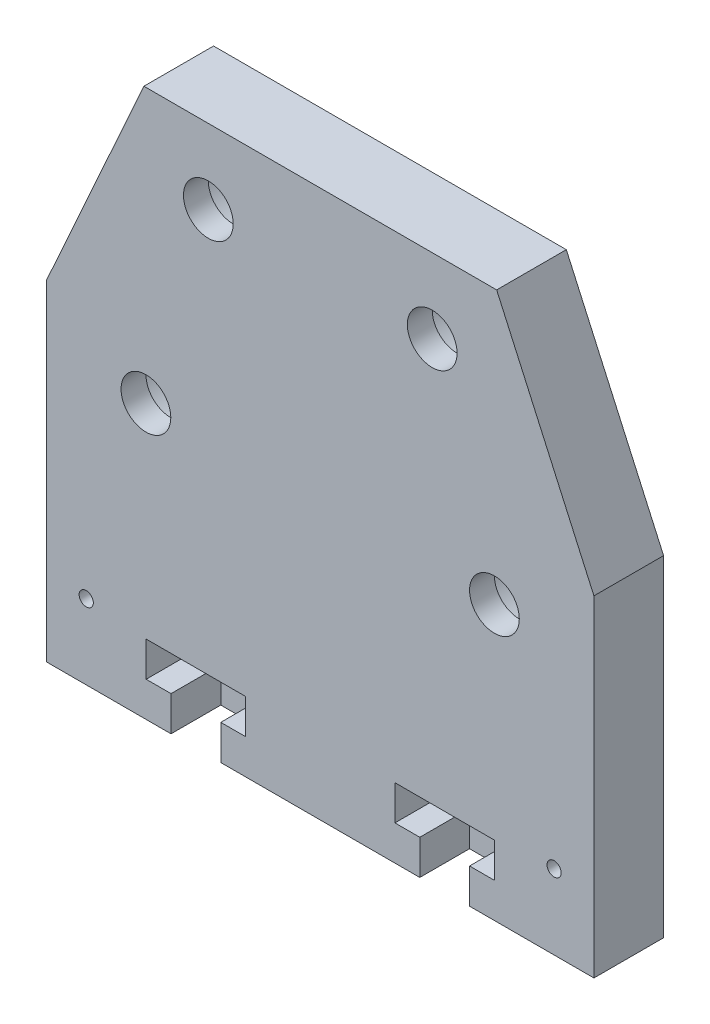
ISO-10303-21;
HEADER;
FILE_DESCRIPTION(('STEP AP214'),'2;1');
FILE_NAME('part.step','',(''),(''),'','','');
FILE_SCHEMA(('AUTOMOTIVE_DESIGN { 1 0 10303 214 1 1 1 1 }'));
ENDSEC;
DATA;
#1=APPLICATION_CONTEXT('core data for automotive mechanical design processes');
#2=APPLICATION_PROTOCOL_DEFINITION('international standard','automotive_design',2000,#1);
#3=PRODUCT_CONTEXT('',#1,'mechanical');
#4=PRODUCT('Part','Part','',(#3));
#5=PRODUCT_RELATED_PRODUCT_CATEGORY('part','',(#4));
#6=PRODUCT_DEFINITION_FORMATION('','',#4);
#7=PRODUCT_DEFINITION_CONTEXT('part definition',#1,'design');
#8=PRODUCT_DEFINITION('design','',#6,#7);
#9=PRODUCT_DEFINITION_SHAPE('','',#8);
#10=(LENGTH_UNIT() NAMED_UNIT(*) SI_UNIT(.MILLI.,.METRE.));
#11=(NAMED_UNIT(*) PLANE_ANGLE_UNIT() SI_UNIT($,.RADIAN.));
#12=(NAMED_UNIT(*) SI_UNIT($,.STERADIAN.) SOLID_ANGLE_UNIT());
#13=UNCERTAINTY_MEASURE_WITH_UNIT(LENGTH_MEASURE(1.E-05),#10,'distance_accuracy_value','');
#14=(GEOMETRIC_REPRESENTATION_CONTEXT(3) GLOBAL_UNCERTAINTY_ASSIGNED_CONTEXT((#13)) GLOBAL_UNIT_ASSIGNED_CONTEXT((#10,
#11,#12)) REPRESENTATION_CONTEXT('',''));
#15=CARTESIAN_POINT('',(0.,0.,0.));
#16=DIRECTION('',(0.,0.,1.));
#17=DIRECTION('',(1.,0.,0.));
#18=AXIS2_PLACEMENT_3D('',#15,#16,#17);
#19=CARTESIAN_POINT('',(104.228904722301,-49.9782608695652,14.));
#20=DIRECTION('',(0.,0.,-1.));
#21=DIRECTION('',(-1.,0.,0.));
#22=AXIS2_PLACEMENT_3D('',#19,#20,#21);
#23=CYLINDRICAL_SURFACE('',#22,11.05);
#24=CARTESIAN_POINT('',(104.228904722301,-49.9782608695652,0.));
#25=DIRECTION('',(0.,0.,1.));
#26=DIRECTION('',(1.,0.,0.));
#27=AXIS2_PLACEMENT_3D('',#24,#25,#26);
#28=CIRCLE('',#27,11.05);
#29=CARTESIAN_POINT('',(115.278904722301,-49.9782608695652,0.));
#30=VERTEX_POINT('',#29);
#31=EDGE_CURVE('E305',#30,#30,#28,.T.);
#32=ORIENTED_EDGE('',*,*,#31,.F.);
#33=EDGE_LOOP('',(#32));
#34=FACE_BOUND('',#33,.T.);
#35=CARTESIAN_POINT('',(104.228904722301,-49.9782608695652,9.));
#36=DIRECTION('',(0.,0.,1.));
#37=DIRECTION('',(1.,0.,0.));
#38=AXIS2_PLACEMENT_3D('',#35,#36,#37);
#39=CIRCLE('',#38,11.05);
#40=CARTESIAN_POINT('',(115.278904722301,-49.9782608695652,9.));
#41=VERTEX_POINT('',#40);
#42=EDGE_CURVE('E836',#41,#41,#39,.T.);
#43=ORIENTED_EDGE('',*,*,#42,.T.);
#44=EDGE_LOOP('',(#43));
#45=FACE_BOUND('',#44,.T.);
#46=ADVANCED_FACE('F32',(#34,#45),#23,.F.);
#47=CARTESIAN_POINT('',(34.187228366783,-49.9782608695652,14.));
#48=DIRECTION('',(0.,0.,-1.));
#49=DIRECTION('',(-1.,0.,0.));
#50=AXIS2_PLACEMENT_3D('',#47,#48,#49);
#51=CYLINDRICAL_SURFACE('',#50,11.05);
#52=CARTESIAN_POINT('',(34.187228366783,-49.9782608695652,0.));
#53=DIRECTION('',(0.,0.,1.));
#54=DIRECTION('',(1.,0.,0.));
#55=AXIS2_PLACEMENT_3D('',#52,#53,#54);
#56=CIRCLE('',#55,11.05);
#57=CARTESIAN_POINT('',(45.237228366783,-49.9782608695652,0.));
#58=VERTEX_POINT('',#57);
#59=EDGE_CURVE('E287',#58,#58,#56,.T.);
#60=ORIENTED_EDGE('',*,*,#59,.F.);
#61=EDGE_LOOP('',(#60));
#62=FACE_BOUND('',#61,.T.);
#63=CARTESIAN_POINT('',(34.187228366783,-49.9782608695652,9.));
#64=DIRECTION('',(0.,0.,1.));
#65=DIRECTION('',(1.,0.,0.));
#66=AXIS2_PLACEMENT_3D('',#63,#64,#65);
#67=CIRCLE('',#66,11.05);
#68=CARTESIAN_POINT('',(45.237228366783,-49.9782608695652,9.));
#69=VERTEX_POINT('',#68);
#70=EDGE_CURVE('E841',#69,#69,#67,.T.);
#71=ORIENTED_EDGE('',*,*,#70,.T.);
#72=EDGE_LOOP('',(#71));
#73=FACE_BOUND('',#72,.T.);
#74=ADVANCED_FACE('F452',(#62,#73),#51,.F.);
#75=CARTESIAN_POINT('',(91.7289047223011,-9.97826086956522,14.));
#76=DIRECTION('',(0.,0.,-1.));
#77=DIRECTION('',(-1.,0.,0.));
#78=AXIS2_PLACEMENT_3D('',#75,#76,#77);
#79=CYLINDRICAL_SURFACE('',#78,11.05);
#80=CARTESIAN_POINT('',(91.7289047223011,-9.97826086956522,0.));
#81=DIRECTION('',(0.,0.,1.));
#82=DIRECTION('',(1.,0.,0.));
#83=AXIS2_PLACEMENT_3D('',#80,#81,#82);
#84=CIRCLE('',#83,11.05);
#85=CARTESIAN_POINT('',(102.778904722301,-9.97826086956522,0.));
#86=VERTEX_POINT('',#85);
#87=EDGE_CURVE('E311',#86,#86,#84,.T.);
#88=ORIENTED_EDGE('',*,*,#87,.F.);
#89=EDGE_LOOP('',(#88));
#90=FACE_BOUND('',#89,.T.);
#91=CARTESIAN_POINT('',(91.7289047223011,-9.97826086956522,9.));
#92=DIRECTION('',(0.,0.,1.));
#93=DIRECTION('',(1.,0.,0.));
#94=AXIS2_PLACEMENT_3D('',#91,#92,#93);
#95=CIRCLE('',#94,11.05);
#96=CARTESIAN_POINT('',(102.778904722301,-9.97826086956522,9.));
#97=VERTEX_POINT('',#96);
#98=EDGE_CURVE('E843',#97,#97,#95,.T.);
#99=ORIENTED_EDGE('',*,*,#98,.T.);
#100=EDGE_LOOP('',(#99));
#101=FACE_BOUND('',#100,.T.);
#102=ADVANCED_FACE('F458',(#90,#101),#79,.F.);
#103=CARTESIAN_POINT('',(46.7289047223011,-9.97826086956521,14.));
#104=DIRECTION('',(0.,0.,-1.));
#105=DIRECTION('',(-1.,0.,0.));
#106=AXIS2_PLACEMENT_3D('',#103,#104,#105);
#107=CYLINDRICAL_SURFACE('',#106,11.05);
#108=CARTESIAN_POINT('',(46.7289047223011,-9.97826086956521,0.));
#109=DIRECTION('',(0.,0.,1.));
#110=DIRECTION('',(1.,0.,0.));
#111=AXIS2_PLACEMENT_3D('',#108,#109,#110);
#112=CIRCLE('',#111,11.05);
#113=CARTESIAN_POINT('',(57.7789047223011,-9.97826086956521,0.));
#114=VERTEX_POINT('',#113);
#115=EDGE_CURVE('E308',#114,#114,#112,.T.);
#116=ORIENTED_EDGE('',*,*,#115,.F.);
#117=EDGE_LOOP('',(#116));
#118=FACE_BOUND('',#117,.T.);
#119=CARTESIAN_POINT('',(46.7289047223011,-9.97826086956521,9.));
#120=DIRECTION('',(0.,0.,1.));
#121=DIRECTION('',(1.,0.,0.));
#122=AXIS2_PLACEMENT_3D('',#119,#120,#121);
#123=CIRCLE('',#122,11.05);
#124=CARTESIAN_POINT('',(57.7789047223011,-9.97826086956521,9.));
#125=VERTEX_POINT('',#124);
#126=EDGE_CURVE('E216',#125,#125,#123,.T.);
#127=ORIENTED_EDGE('',*,*,#126,.T.);
#128=EDGE_LOOP('',(#127));
#129=FACE_BOUND('',#128,.T.);
#130=ADVANCED_FACE('F465',(#118,#129),#107,.F.);
#131=CARTESIAN_POINT('',(0.,0.,14.));
#132=DIRECTION('',(0.,0.,-1.));
#133=DIRECTION('',(-1.,0.,0.));
#134=AXIS2_PLACEMENT_3D('',#131,#132,#133);
#135=PLANE('',#134);
#136=CARTESIAN_POINT('',(116.228904722301,-89.9782608695652,14.));
#137=DIRECTION('',(0.,0.,1.));
#138=DIRECTION('',(1.,0.,0.));
#139=AXIS2_PLACEMENT_3D('',#136,#137,#138);
#140=CIRCLE('',#139,1.425);
#141=CARTESIAN_POINT('',(117.653904722301,-89.9782608695652,14.));
#142=VERTEX_POINT('',#141);
#143=EDGE_CURVE('E824',#142,#142,#140,.T.);
#144=ORIENTED_EDGE('',*,*,#143,.F.);
#145=EDGE_LOOP('',(#144));
#146=FACE_BOUND('',#145,.T.);
#147=CARTESIAN_POINT('',(22.187228366783,-89.9782608695652,14.));
#148=DIRECTION('',(0.,0.,1.));
#149=DIRECTION('',(1.,0.,0.));
#150=AXIS2_PLACEMENT_3D('',#147,#148,#149);
#151=CIRCLE('',#150,1.425);
#152=CARTESIAN_POINT('',(23.612228366783,-89.9782608695652,14.));
#153=VERTEX_POINT('',#152);
#154=EDGE_CURVE('E830',#153,#153,#151,.T.);
#155=ORIENTED_EDGE('',*,*,#154,.F.);
#156=EDGE_LOOP('',(#155));
#157=FACE_BOUND('',#156,.T.);
#158=DIRECTION('',(0.,-1.,0.));
#159=VECTOR('',#158,1.);
#160=CARTESIAN_POINT('',(99.231884057971,0.,14.));
#161=LINE('',#160,#159);
#162=CARTESIAN_POINT('',(99.231884057971,-97.9782608695652,14.));
#163=VERTEX_POINT('',#162);
#164=CARTESIAN_POINT('',(99.231884057971,-104.978260869565,14.));
#165=VERTEX_POINT('',#164);
#166=EDGE_CURVE('E212',#163,#165,#161,.T.);
#167=ORIENTED_EDGE('',*,*,#166,.T.);
#168=DIRECTION('',(1.,0.,0.));
#169=VECTOR('',#168,1.);
#170=CARTESIAN_POINT('',(124.228904722301,-104.978260869565,14.));
#171=LINE('',#170,#169);
#172=CARTESIAN_POINT('',(124.228904722301,-104.978260869565,14.));
#173=VERTEX_POINT('',#172);
#174=EDGE_CURVE('E327',#165,#173,#171,.T.);
#175=ORIENTED_EDGE('',*,*,#174,.T.);
#176=DIRECTION('',(0.,1.,0.));
#177=VECTOR('',#176,1.);
#178=CARTESIAN_POINT('',(124.228904722301,-38.4636097407532,14.));
#179=LINE('',#178,#177);
#180=CARTESIAN_POINT('',(124.228904722301,-38.4636097407532,14.));
#181=VERTEX_POINT('',#180);
#182=EDGE_CURVE('E315',#173,#181,#179,.T.);
#183=ORIENTED_EDGE('',*,*,#182,.T.);
#184=DIRECTION('',(-0.41,0.912085522305886,0.));
#185=VECTOR('',#184,1.);
#186=CARTESIAN_POINT('',(104.681403308056,5.02173913043479,14.));
#187=LINE('',#186,#185);
#188=CARTESIAN_POINT('',(104.681403308056,5.02173913043479,14.));
#189=VERTEX_POINT('',#188);
#190=EDGE_CURVE('E318',#181,#189,#187,.T.);
#191=ORIENTED_EDGE('',*,*,#190,.T.);
#192=DIRECTION('',(-1.,0.,0.));
#193=VECTOR('',#192,1.);
#194=CARTESIAN_POINT('',(104.681403308056,5.02173913043479,14.));
#195=LINE('',#194,#193);
#196=CARTESIAN_POINT('',(33.7823648078864,5.02173913043478,14.));
#197=VERTEX_POINT('',#196);
#198=EDGE_CURVE('E321',#189,#197,#195,.T.);
#199=ORIENTED_EDGE('',*,*,#198,.T.);
#200=DIRECTION('',(-0.41,-0.912085522305886,0.));
#201=VECTOR('',#200,1.);
#202=CARTESIAN_POINT('',(33.7823648078864,5.02173913043478,14.));
#203=LINE('',#202,#201);
#204=CARTESIAN_POINT('',(14.187228366783,-38.5695785660015,14.));
#205=VERTEX_POINT('',#204);
#206=EDGE_CURVE('E323',#197,#205,#203,.T.);
#207=ORIENTED_EDGE('',*,*,#206,.T.);
#208=DIRECTION('',(0.,-1.,0.));
#209=VECTOR('',#208,1.);
#210=CARTESIAN_POINT('',(14.187228366783,-38.5695785660015,14.));
#211=LINE('',#210,#209);
#212=CARTESIAN_POINT('',(14.187228366783,-104.978260869565,14.));
#213=VERTEX_POINT('',#212);
#214=EDGE_CURVE('E325',#205,#213,#211,.T.);
#215=ORIENTED_EDGE('',*,*,#214,.T.);
#216=CARTESIAN_POINT('',(39.231884057971,-104.978260869565,14.));
#217=VERTEX_POINT('',#216);
#218=EDGE_CURVE('E328',#213,#217,#171,.T.);
#219=ORIENTED_EDGE('',*,*,#218,.T.);
#220=DIRECTION('',(0.,-1.,0.));
#221=VECTOR('',#220,1.);
#222=CARTESIAN_POINT('',(39.231884057971,0.,14.));
#223=LINE('',#222,#221);
#224=CARTESIAN_POINT('',(39.231884057971,-97.9782608695652,14.));
#225=VERTEX_POINT('',#224);
#226=EDGE_CURVE('E280',#225,#217,#223,.T.);
#227=ORIENTED_EDGE('',*,*,#226,.F.);
#228=DIRECTION('',(1.,0.,0.));
#229=VECTOR('',#228,1.);
#230=CARTESIAN_POINT('',(0.,-97.9782608695652,14.));
#231=LINE('',#230,#229);
#232=CARTESIAN_POINT('',(34.231884057971,-97.9782608695652,14.));
#233=VERTEX_POINT('',#232);
#234=EDGE_CURVE('E277',#233,#225,#231,.T.);
#235=ORIENTED_EDGE('',*,*,#234,.F.);
#236=DIRECTION('',(0.,-1.,0.));
#237=VECTOR('',#236,1.);
#238=CARTESIAN_POINT('',(34.2318840579711,0.,14.));
#239=LINE('',#238,#237);
#240=CARTESIAN_POINT('',(34.231884057971,-90.9782608695652,14.));
#241=VERTEX_POINT('',#240);
#242=EDGE_CURVE('E274',#241,#233,#239,.T.);
#243=ORIENTED_EDGE('',*,*,#242,.F.);
#244=DIRECTION('',(1.,0.,0.));
#245=VECTOR('',#244,1.);
#246=CARTESIAN_POINT('',(0.,-90.9782608695652,14.));
#247=LINE('',#246,#245);
#248=CARTESIAN_POINT('',(54.231884057971,-90.9782608695652,14.));
#249=VERTEX_POINT('',#248);
#250=EDGE_CURVE('E271',#241,#249,#247,.T.);
#251=ORIENTED_EDGE('',*,*,#250,.T.);
#252=DIRECTION('',(0.,-1.,0.));
#253=VECTOR('',#252,1.);
#254=CARTESIAN_POINT('',(54.2318840579709,0.,14.));
#255=LINE('',#254,#253);
#256=CARTESIAN_POINT('',(54.231884057971,-97.9782608695652,14.));
#257=VERTEX_POINT('',#256);
#258=EDGE_CURVE('E240',#249,#257,#255,.T.);
#259=ORIENTED_EDGE('',*,*,#258,.T.);
#260=CARTESIAN_POINT('',(49.231884057971,-97.9782608695652,14.));
#261=VERTEX_POINT('',#260);
#262=EDGE_CURVE('E256',#261,#257,#231,.T.);
#263=ORIENTED_EDGE('',*,*,#262,.F.);
#264=DIRECTION('',(0.,-1.,0.));
#265=VECTOR('',#264,1.);
#266=CARTESIAN_POINT('',(49.2318840579711,0.,14.));
#267=LINE('',#266,#265);
#268=CARTESIAN_POINT('',(49.231884057971,-104.978260869565,14.));
#269=VERTEX_POINT('',#268);
#270=EDGE_CURVE('E282',#261,#269,#267,.T.);
#271=ORIENTED_EDGE('',*,*,#270,.T.);
#272=CARTESIAN_POINT('',(89.231884057971,-104.978260869565,14.));
#273=VERTEX_POINT('',#272);
#274=EDGE_CURVE('E332',#269,#273,#171,.T.);
#275=ORIENTED_EDGE('',*,*,#274,.T.);
#276=DIRECTION('',(0.,-1.,0.));
#277=VECTOR('',#276,1.);
#278=CARTESIAN_POINT('',(89.231884057971,0.,14.));
#279=LINE('',#278,#277);
#280=CARTESIAN_POINT('',(89.231884057971,-97.9782608695652,14.));
#281=VERTEX_POINT('',#280);
#282=EDGE_CURVE('E234',#281,#273,#279,.T.);
#283=ORIENTED_EDGE('',*,*,#282,.F.);
#284=DIRECTION('',(1.,0.,0.));
#285=VECTOR('',#284,1.);
#286=CARTESIAN_POINT('',(0.,-97.9782608695652,14.));
#287=LINE('',#286,#285);
#288=CARTESIAN_POINT('',(84.231884057971,-97.9782608695652,14.));
#289=VERTEX_POINT('',#288);
#290=EDGE_CURVE('E214',#289,#281,#287,.T.);
#291=ORIENTED_EDGE('',*,*,#290,.F.);
#292=DIRECTION('',(0.,-1.,0.));
#293=VECTOR('',#292,1.);
#294=CARTESIAN_POINT('',(84.231884057971,0.,14.));
#295=LINE('',#294,#293);
#296=CARTESIAN_POINT('',(84.231884057971,-90.9782608695652,14.));
#297=VERTEX_POINT('',#296);
#298=EDGE_CURVE('E230',#297,#289,#295,.T.);
#299=ORIENTED_EDGE('',*,*,#298,.F.);
#300=DIRECTION('',(1.,0.,0.));
#301=VECTOR('',#300,1.);
#302=CARTESIAN_POINT('',(0.,-90.9782608695652,14.));
#303=LINE('',#302,#301);
#304=CARTESIAN_POINT('',(104.231884057971,-90.9782608695652,14.));
#305=VERTEX_POINT('',#304);
#306=EDGE_CURVE('E228',#297,#305,#303,.T.);
#307=ORIENTED_EDGE('',*,*,#306,.T.);
#308=DIRECTION('',(0.,-1.,0.));
#309=VECTOR('',#308,1.);
#310=CARTESIAN_POINT('',(104.231884057971,0.,14.));
#311=LINE('',#310,#309);
#312=CARTESIAN_POINT('',(104.231884057971,-97.9782608695652,14.));
#313=VERTEX_POINT('',#312);
#314=EDGE_CURVE('E201',#305,#313,#311,.T.);
#315=ORIENTED_EDGE('',*,*,#314,.T.);
#316=EDGE_CURVE('E209',#163,#313,#287,.T.);
#317=ORIENTED_EDGE('',*,*,#316,.F.);
#318=EDGE_LOOP('',(#167,#175,#183,#191,#199,#207,#215,#219,#227,#235,#243,#251,#259,#263,#271,
#275,#283,#291,#299,#307,#315,#317));
#319=FACE_BOUND('',#318,.T.);
#320=CARTESIAN_POINT('',(46.7289047223011,-9.97826086956521,14.));
#321=DIRECTION('',(0.,0.,1.));
#322=DIRECTION('',(1.,0.,0.));
#323=AXIS2_PLACEMENT_3D('',#320,#321,#322);
#324=CIRCLE('',#323,5.);
#325=CARTESIAN_POINT('',(51.7289047223011,-9.97826086956521,14.));
#326=VERTEX_POINT('',#325);
#327=EDGE_CURVE('E818',#326,#326,#324,.T.);
#328=ORIENTED_EDGE('',*,*,#327,.F.);
#329=EDGE_LOOP('',(#328));
#330=FACE_BOUND('',#329,.T.);
#331=CARTESIAN_POINT('',(91.7289047223011,-9.97826086956522,14.));
#332=DIRECTION('',(0.,0.,1.));
#333=DIRECTION('',(1.,0.,0.));
#334=AXIS2_PLACEMENT_3D('',#331,#332,#333);
#335=CIRCLE('',#334,5.);
#336=CARTESIAN_POINT('',(96.7289047223011,-9.97826086956522,14.));
#337=VERTEX_POINT('',#336);
#338=EDGE_CURVE('E812',#337,#337,#335,.T.);
#339=ORIENTED_EDGE('',*,*,#338,.F.);
#340=EDGE_LOOP('',(#339));
#341=FACE_BOUND('',#340,.T.);
#342=CARTESIAN_POINT('',(104.228904722301,-49.9782608695652,14.));
#343=DIRECTION('',(0.,0.,1.));
#344=DIRECTION('',(1.,0.,0.));
#345=AXIS2_PLACEMENT_3D('',#342,#343,#344);
#346=CIRCLE('',#345,5.00000000000001);
#347=CARTESIAN_POINT('',(109.228904722301,-49.9782608695652,14.));
#348=VERTEX_POINT('',#347);
#349=EDGE_CURVE('E806',#348,#348,#346,.T.);
#350=ORIENTED_EDGE('',*,*,#349,.F.);
#351=EDGE_LOOP('',(#350));
#352=FACE_BOUND('',#351,.T.);
#353=CARTESIAN_POINT('',(34.187228366783,-49.9782608695652,14.));
#354=DIRECTION('',(0.,0.,1.));
#355=DIRECTION('',(1.,0.,0.));
#356=AXIS2_PLACEMENT_3D('',#353,#354,#355);
#357=CIRCLE('',#356,5.);
#358=CARTESIAN_POINT('',(39.187228366783,-49.9782608695652,14.));
#359=VERTEX_POINT('',#358);
#360=EDGE_CURVE('E803',#359,#359,#357,.T.);
#361=ORIENTED_EDGE('',*,*,#360,.F.);
#362=EDGE_LOOP('',(#361));
#363=FACE_BOUND('',#362,.T.);
#364=ADVANCED_FACE('F379',(#146,#157,#319,#330,#341,#352,#363),#135,.F.);
#365=CARTESIAN_POINT('',(124.228904722301,-104.978260869565,14.));
#366=DIRECTION('',(0.,1.,0.));
#367=DIRECTION('',(0.,0.,1.));
#368=AXIS2_PLACEMENT_3D('',#365,#366,#367);
#369=PLANE('',#368);
#370=DIRECTION('',(0.,0.,1.));
#371=VECTOR('',#370,1.);
#372=CARTESIAN_POINT('',(99.231884057971,-104.978260869565,4.));
#373=LINE('',#372,#371);
#374=CARTESIAN_POINT('',(99.231884057971,-104.978260869565,4.));
#375=VERTEX_POINT('',#374);
#376=EDGE_CURVE('E243',#375,#165,#373,.T.);
#377=ORIENTED_EDGE('',*,*,#376,.F.);
#378=DIRECTION('',(1.,0.,0.));
#379=VECTOR('',#378,1.);
#380=CARTESIAN_POINT('',(0.,-104.978260869565,4.));
#381=LINE('',#380,#379);
#382=CARTESIAN_POINT('',(89.231884057971,-104.978260869565,4.));
#383=VERTEX_POINT('',#382);
#384=EDGE_CURVE('E223',#383,#375,#381,.T.);
#385=ORIENTED_EDGE('',*,*,#384,.F.);
#386=DIRECTION('',(0.,0.,1.));
#387=VECTOR('',#386,1.);
#388=CARTESIAN_POINT('',(89.231884057971,-104.978260869565,4.));
#389=LINE('',#388,#387);
#390=EDGE_CURVE('E245',#383,#273,#389,.T.);
#391=ORIENTED_EDGE('',*,*,#390,.T.);
#392=ORIENTED_EDGE('',*,*,#274,.F.);
#393=DIRECTION('',(0.,0.,1.));
#394=VECTOR('',#393,1.);
#395=CARTESIAN_POINT('',(49.231884057971,-104.978260869565,4.));
#396=LINE('',#395,#394);
#397=CARTESIAN_POINT('',(49.231884057971,-104.978260869565,4.));
#398=VERTEX_POINT('',#397);
#399=EDGE_CURVE('E290',#398,#269,#396,.T.);
#400=ORIENTED_EDGE('',*,*,#399,.F.);
#401=DIRECTION('',(1.,0.,0.));
#402=VECTOR('',#401,1.);
#403=CARTESIAN_POINT('',(0.,-104.978260869565,4.));
#404=LINE('',#403,#402);
#405=CARTESIAN_POINT('',(39.231884057971,-104.978260869565,4.));
#406=VERTEX_POINT('',#405);
#407=EDGE_CURVE('E265',#406,#398,#404,.T.);
#408=ORIENTED_EDGE('',*,*,#407,.F.);
#409=DIRECTION('',(0.,0.,1.));
#410=VECTOR('',#409,1.);
#411=CARTESIAN_POINT('',(39.231884057971,-104.978260869565,4.));
#412=LINE('',#411,#410);
#413=EDGE_CURVE('E292',#406,#217,#412,.T.);
#414=ORIENTED_EDGE('',*,*,#413,.T.);
#415=ORIENTED_EDGE('',*,*,#218,.F.);
#416=DIRECTION('',(0.,0.,-1.));
#417=VECTOR('',#416,1.);
#418=CARTESIAN_POINT('',(14.187228366783,-104.978260869565,14.));
#419=LINE('',#418,#417);
#420=CARTESIAN_POINT('',(14.187228366783,-104.978260869565,0.));
#421=VERTEX_POINT('',#420);
#422=EDGE_CURVE('E346',#213,#421,#419,.T.);
#423=ORIENTED_EDGE('',*,*,#422,.T.);
#424=DIRECTION('',(1.,0.,0.));
#425=VECTOR('',#424,1.);
#426=CARTESIAN_POINT('',(124.228904722301,-104.978260869565,0.));
#427=LINE('',#426,#425);
#428=CARTESIAN_POINT('',(124.228904722301,-104.978260869565,0.));
#429=VERTEX_POINT('',#428);
#430=EDGE_CURVE('E319',#421,#429,#427,.T.);
#431=ORIENTED_EDGE('',*,*,#430,.T.);
#432=DIRECTION('',(0.,0.,-1.));
#433=VECTOR('',#432,1.);
#434=CARTESIAN_POINT('',(124.228904722301,-104.978260869565,14.));
#435=LINE('',#434,#433);
#436=EDGE_CURVE('E331',#173,#429,#435,.T.);
#437=ORIENTED_EDGE('',*,*,#436,.F.);
#438=ORIENTED_EDGE('',*,*,#174,.F.);
#439=EDGE_LOOP('',(#377,#385,#391,#392,#400,#408,#414,#415,#423,#431,#437,#438));
#440=FACE_BOUND('',#439,.T.);
#441=ADVANCED_FACE('F389',(#440),#369,.F.);
#442=CARTESIAN_POINT('',(0.,0.,0.));
#443=DIRECTION('',(0.,0.,-1.));
#444=DIRECTION('',(-1.,0.,0.));
#445=AXIS2_PLACEMENT_3D('',#442,#443,#444);
#446=PLANE('',#445);
#447=CARTESIAN_POINT('',(116.228904722301,-89.9782608695652,0.));
#448=DIRECTION('',(0.,0.,1.));
#449=DIRECTION('',(1.,0.,0.));
#450=AXIS2_PLACEMENT_3D('',#447,#448,#449);
#451=CIRCLE('',#450,1.425);
#452=CARTESIAN_POINT('',(117.653904722301,-89.9782608695652,0.));
#453=VERTEX_POINT('',#452);
#454=EDGE_CURVE('E827',#453,#453,#451,.T.);
#455=ORIENTED_EDGE('',*,*,#454,.T.);
#456=EDGE_LOOP('',(#455));
#457=FACE_BOUND('',#456,.T.);
#458=CARTESIAN_POINT('',(22.187228366783,-89.9782608695652,0.));
#459=DIRECTION('',(0.,0.,1.));
#460=DIRECTION('',(1.,0.,0.));
#461=AXIS2_PLACEMENT_3D('',#458,#459,#460);
#462=CIRCLE('',#461,1.425);
#463=CARTESIAN_POINT('',(23.612228366783,-89.9782608695652,0.));
#464=VERTEX_POINT('',#463);
#465=EDGE_CURVE('E833',#464,#464,#462,.T.);
#466=ORIENTED_EDGE('',*,*,#465,.T.);
#467=EDGE_LOOP('',(#466));
#468=FACE_BOUND('',#467,.T.);
#469=ORIENTED_EDGE('',*,*,#31,.T.);
#470=EDGE_LOOP('',(#469));
#471=FACE_BOUND('',#470,.T.);
#472=ORIENTED_EDGE('',*,*,#87,.T.);
#473=EDGE_LOOP('',(#472));
#474=FACE_BOUND('',#473,.T.);
#475=DIRECTION('',(0.,1.,0.));
#476=VECTOR('',#475,1.);
#477=CARTESIAN_POINT('',(124.228904722301,-38.4636097407532,0.));
#478=LINE('',#477,#476);
#479=CARTESIAN_POINT('',(124.228904722301,-38.4636097407532,0.));
#480=VERTEX_POINT('',#479);
#481=EDGE_CURVE('E314',#429,#480,#478,.T.);
#482=ORIENTED_EDGE('',*,*,#481,.F.);
#483=ORIENTED_EDGE('',*,*,#430,.F.);
#484=DIRECTION('',(0.,-1.,0.));
#485=VECTOR('',#484,1.);
#486=CARTESIAN_POINT('',(14.187228366783,-38.5695785660015,0.));
#487=LINE('',#486,#485);
#488=CARTESIAN_POINT('',(14.187228366783,-38.5695785660015,0.));
#489=VERTEX_POINT('',#488);
#490=EDGE_CURVE('E341',#489,#421,#487,.T.);
#491=ORIENTED_EDGE('',*,*,#490,.F.);
#492=DIRECTION('',(-0.41,-0.912085522305886,0.));
#493=VECTOR('',#492,1.);
#494=CARTESIAN_POINT('',(33.7823648078864,5.02173913043478,0.));
#495=LINE('',#494,#493);
#496=CARTESIAN_POINT('',(33.7823648078864,5.02173913043478,0.));
#497=VERTEX_POINT('',#496);
#498=EDGE_CURVE('E339',#497,#489,#495,.T.);
#499=ORIENTED_EDGE('',*,*,#498,.F.);
#500=DIRECTION('',(-1.,0.,0.));
#501=VECTOR('',#500,1.);
#502=CARTESIAN_POINT('',(104.681403308056,5.02173913043479,0.));
#503=LINE('',#502,#501);
#504=CARTESIAN_POINT('',(104.681403308056,5.02173913043479,0.));
#505=VERTEX_POINT('',#504);
#506=EDGE_CURVE('E337',#505,#497,#503,.T.);
#507=ORIENTED_EDGE('',*,*,#506,.F.);
#508=DIRECTION('',(-0.41,0.912085522305886,0.));
#509=VECTOR('',#508,1.);
#510=CARTESIAN_POINT('',(104.681403308056,5.02173913043479,0.));
#511=LINE('',#510,#509);
#512=EDGE_CURVE('E335',#480,#505,#511,.T.);
#513=ORIENTED_EDGE('',*,*,#512,.F.);
#514=EDGE_LOOP('',(#482,#483,#491,#499,#507,#513));
#515=FACE_BOUND('',#514,.T.);
#516=ORIENTED_EDGE('',*,*,#115,.T.);
#517=EDGE_LOOP('',(#516));
#518=FACE_BOUND('',#517,.T.);
#519=ORIENTED_EDGE('',*,*,#59,.T.);
#520=EDGE_LOOP('',(#519));
#521=FACE_BOUND('',#520,.T.);
#522=ADVANCED_FACE('F365',(#457,#468,#471,#474,#515,#518,#521),#446,.T.);
#523=CARTESIAN_POINT('',(124.228904722301,-38.4636097407532,14.));
#524=DIRECTION('',(-1.,0.,0.));
#525=DIRECTION('',(0.,-1.,0.));
#526=AXIS2_PLACEMENT_3D('',#523,#524,#525);
#527=PLANE('',#526);
#528=ORIENTED_EDGE('',*,*,#481,.T.);
#529=DIRECTION('',(0.,0.,-1.));
#530=VECTOR('',#529,1.);
#531=CARTESIAN_POINT('',(124.228904722301,-38.4636097407532,14.));
#532=LINE('',#531,#530);
#533=EDGE_CURVE('E11',#181,#480,#532,.T.);
#534=ORIENTED_EDGE('',*,*,#533,.F.);
#535=ORIENTED_EDGE('',*,*,#182,.F.);
#536=ORIENTED_EDGE('',*,*,#436,.T.);
#537=EDGE_LOOP('',(#528,#534,#535,#536));
#538=FACE_BOUND('',#537,.T.);
#539=ADVANCED_FACE('F34',(#538),#527,.F.);
#540=CARTESIAN_POINT('',(104.681403308056,5.02173913043479,14.));
#541=DIRECTION('',(-0.912085522305886,-0.41,0.));
#542=DIRECTION('',(0.41,-0.912085522305886,0.));
#543=AXIS2_PLACEMENT_3D('',#540,#541,#542);
#544=PLANE('',#543);
#545=ORIENTED_EDGE('',*,*,#512,.T.);
#546=DIRECTION('',(0.,0.,-1.));
#547=VECTOR('',#546,1.);
#548=CARTESIAN_POINT('',(104.681403308056,5.02173913043479,14.));
#549=LINE('',#548,#547);
#550=EDGE_CURVE('E40',#189,#505,#549,.T.);
#551=ORIENTED_EDGE('',*,*,#550,.F.);
#552=ORIENTED_EDGE('',*,*,#190,.F.);
#553=ORIENTED_EDGE('',*,*,#533,.T.);
#554=EDGE_LOOP('',(#545,#551,#552,#553));
#555=FACE_BOUND('',#554,.T.);
#556=ADVANCED_FACE('F384',(#555),#544,.F.);
#557=CARTESIAN_POINT('',(104.681403308056,5.02173913043479,14.));
#558=DIRECTION('',(0.,-1.,0.));
#559=DIRECTION('',(1.,0.,0.));
#560=AXIS2_PLACEMENT_3D('',#557,#558,#559);
#561=PLANE('',#560);
#562=ORIENTED_EDGE('',*,*,#506,.T.);
#563=DIRECTION('',(0.,0.,-1.));
#564=VECTOR('',#563,1.);
#565=CARTESIAN_POINT('',(33.7823648078864,5.02173913043478,14.));
#566=LINE('',#565,#564);
#567=EDGE_CURVE('E352',#197,#497,#566,.T.);
#568=ORIENTED_EDGE('',*,*,#567,.F.);
#569=ORIENTED_EDGE('',*,*,#198,.F.);
#570=ORIENTED_EDGE('',*,*,#550,.T.);
#571=EDGE_LOOP('',(#562,#568,#569,#570));
#572=FACE_BOUND('',#571,.T.);
#573=ADVANCED_FACE('F359',(#572),#561,.F.);
#574=CARTESIAN_POINT('',(33.7823648078864,5.02173913043478,14.));
#575=DIRECTION('',(0.912085522305885,-0.41,0.));
#576=DIRECTION('',(0.41,0.912085522305885,0.));
#577=AXIS2_PLACEMENT_3D('',#574,#575,#576);
#578=PLANE('',#577);
#579=ORIENTED_EDGE('',*,*,#498,.T.);
#580=DIRECTION('',(0.,0.,-1.));
#581=VECTOR('',#580,1.);
#582=CARTESIAN_POINT('',(14.187228366783,-38.5695785660015,14.));
#583=LINE('',#582,#581);
#584=EDGE_CURVE('E349',#205,#489,#583,.T.);
#585=ORIENTED_EDGE('',*,*,#584,.F.);
#586=ORIENTED_EDGE('',*,*,#206,.F.);
#587=ORIENTED_EDGE('',*,*,#567,.T.);
#588=EDGE_LOOP('',(#579,#585,#586,#587));
#589=FACE_BOUND('',#588,.T.);
#590=ADVANCED_FACE('F371',(#589),#578,.F.);
#591=CARTESIAN_POINT('',(14.187228366783,-38.5695785660015,14.));
#592=DIRECTION('',(1.,0.,0.));
#593=DIRECTION('',(0.,1.,0.));
#594=AXIS2_PLACEMENT_3D('',#591,#592,#593);
#595=PLANE('',#594);
#596=ORIENTED_EDGE('',*,*,#490,.T.);
#597=ORIENTED_EDGE('',*,*,#422,.F.);
#598=ORIENTED_EDGE('',*,*,#214,.F.);
#599=ORIENTED_EDGE('',*,*,#584,.T.);
#600=EDGE_LOOP('',(#596,#597,#598,#599));
#601=FACE_BOUND('',#600,.T.);
#602=ADVANCED_FACE('F375',(#601),#595,.F.);
#603=CARTESIAN_POINT('',(54.2318840579709,0.,4.));
#604=DIRECTION('',(-1.,0.,0.));
#605=DIRECTION('',(0.,-1.,0.));
#606=AXIS2_PLACEMENT_3D('',#603,#604,#605);
#607=PLANE('',#606);
#608=ORIENTED_EDGE('',*,*,#258,.F.);
#609=DIRECTION('',(0.,0.,1.));
#610=VECTOR('',#609,1.);
#611=CARTESIAN_POINT('',(54.231884057971,-90.9782608695652,4.));
#612=LINE('',#611,#610);
#613=CARTESIAN_POINT('',(54.231884057971,-90.9782608695652,4.));
#614=VERTEX_POINT('',#613);
#615=EDGE_CURVE('E301',#614,#249,#612,.T.);
#616=ORIENTED_EDGE('',*,*,#615,.F.);
#617=DIRECTION('',(0.,-1.,0.));
#618=VECTOR('',#617,1.);
#619=CARTESIAN_POINT('',(54.2318840579709,0.,4.));
#620=LINE('',#619,#618);
#621=CARTESIAN_POINT('',(54.231884057971,-97.9782608695652,4.));
#622=VERTEX_POINT('',#621);
#623=EDGE_CURVE('E253',#614,#622,#620,.T.);
#624=ORIENTED_EDGE('',*,*,#623,.T.);
#625=DIRECTION('',(0.,0.,1.));
#626=VECTOR('',#625,1.);
#627=CARTESIAN_POINT('',(54.231884057971,-97.9782608695652,4.));
#628=LINE('',#627,#626);
#629=EDGE_CURVE('E285',#622,#257,#628,.T.);
#630=ORIENTED_EDGE('',*,*,#629,.T.);
#631=EDGE_LOOP('',(#608,#616,#624,#630));
#632=FACE_BOUND('',#631,.T.);
#633=ADVANCED_FACE('F412',(#632),#607,.T.);
#634=CARTESIAN_POINT('',(0.,-97.9782608695652,4.));
#635=DIRECTION('',(0.,-1.,0.));
#636=DIRECTION('',(0.,0.,-1.));
#637=AXIS2_PLACEMENT_3D('',#634,#635,#636);
#638=PLANE('',#637);
#639=ORIENTED_EDGE('',*,*,#262,.T.);
#640=ORIENTED_EDGE('',*,*,#629,.F.);
#641=DIRECTION('',(1.,0.,0.));
#642=VECTOR('',#641,1.);
#643=CARTESIAN_POINT('',(0.,-97.9782608695652,4.));
#644=LINE('',#643,#642);
#645=CARTESIAN_POINT('',(49.231884057971,-97.9782608695652,4.));
#646=VERTEX_POINT('',#645);
#647=EDGE_CURVE('E263',#646,#622,#644,.T.);
#648=ORIENTED_EDGE('',*,*,#647,.F.);
#649=DIRECTION('',(0.,0.,1.));
#650=VECTOR('',#649,1.);
#651=CARTESIAN_POINT('',(49.231884057971,-97.9782608695652,4.));
#652=LINE('',#651,#650);
#653=EDGE_CURVE('E288',#646,#261,#652,.T.);
#654=ORIENTED_EDGE('',*,*,#653,.T.);
#655=EDGE_LOOP('',(#639,#640,#648,#654));
#656=FACE_BOUND('',#655,.T.);
#657=ADVANCED_FACE('F418',(#656),#638,.F.);
#658=CARTESIAN_POINT('',(49.2318840579711,0.,4.));
#659=DIRECTION('',(-1.,0.,0.));
#660=DIRECTION('',(0.,-1.,0.));
#661=AXIS2_PLACEMENT_3D('',#658,#659,#660);
#662=PLANE('',#661);
#663=ORIENTED_EDGE('',*,*,#270,.F.);
#664=ORIENTED_EDGE('',*,*,#653,.F.);
#665=DIRECTION('',(0.,-1.,0.));
#666=VECTOR('',#665,1.);
#667=CARTESIAN_POINT('',(49.2318840579711,0.,4.));
#668=LINE('',#667,#666);
#669=EDGE_CURVE('E267',#646,#398,#668,.T.);
#670=ORIENTED_EDGE('',*,*,#669,.T.);
#671=ORIENTED_EDGE('',*,*,#399,.T.);
#672=EDGE_LOOP('',(#663,#664,#670,#671));
#673=FACE_BOUND('',#672,.T.);
#674=ADVANCED_FACE('F422',(#673),#662,.T.);
#675=CARTESIAN_POINT('',(39.231884057971,0.,4.));
#676=DIRECTION('',(-1.,0.,0.));
#677=DIRECTION('',(0.,0.,1.));
#678=AXIS2_PLACEMENT_3D('',#675,#676,#677);
#679=PLANE('',#678);
#680=ORIENTED_EDGE('',*,*,#226,.T.);
#681=ORIENTED_EDGE('',*,*,#413,.F.);
#682=DIRECTION('',(0.,-1.,0.));
#683=VECTOR('',#682,1.);
#684=CARTESIAN_POINT('',(39.231884057971,0.,4.));
#685=LINE('',#684,#683);
#686=CARTESIAN_POINT('',(39.231884057971,-97.9782608695652,4.));
#687=VERTEX_POINT('',#686);
#688=EDGE_CURVE('E55',#687,#406,#685,.T.);
#689=ORIENTED_EDGE('',*,*,#688,.F.);
#690=DIRECTION('',(0.,0.,1.));
#691=VECTOR('',#690,1.);
#692=CARTESIAN_POINT('',(39.231884057971,-97.9782608695652,4.));
#693=LINE('',#692,#691);
#694=EDGE_CURVE('E295',#687,#225,#693,.T.);
#695=ORIENTED_EDGE('',*,*,#694,.T.);
#696=EDGE_LOOP('',(#680,#681,#689,#695));
#697=FACE_BOUND('',#696,.T.);
#698=ADVANCED_FACE('F394',(#697),#679,.F.);
#699=ORIENTED_EDGE('',*,*,#234,.T.);
#700=ORIENTED_EDGE('',*,*,#694,.F.);
#701=CARTESIAN_POINT('',(34.231884057971,-97.9782608695652,4.));
#702=VERTEX_POINT('',#701);
#703=EDGE_CURVE('E261',#702,#687,#644,.T.);
#704=ORIENTED_EDGE('',*,*,#703,.F.);
#705=DIRECTION('',(0.,0.,1.));
#706=VECTOR('',#705,1.);
#707=CARTESIAN_POINT('',(34.231884057971,-97.9782608695652,4.));
#708=LINE('',#707,#706);
#709=EDGE_CURVE('E297',#702,#233,#708,.T.);
#710=ORIENTED_EDGE('',*,*,#709,.T.);
#711=EDGE_LOOP('',(#699,#700,#704,#710));
#712=FACE_BOUND('',#711,.T.);
#713=ADVANCED_FACE('F398',(#712),#638,.F.);
#714=CARTESIAN_POINT('',(34.2318840579711,0.,4.));
#715=DIRECTION('',(-1.,0.,0.));
#716=DIRECTION('',(0.,-1.,0.));
#717=AXIS2_PLACEMENT_3D('',#714,#715,#716);
#718=PLANE('',#717);
#719=ORIENTED_EDGE('',*,*,#242,.T.);
#720=ORIENTED_EDGE('',*,*,#709,.F.);
#721=DIRECTION('',(0.,-1.,0.));
#722=VECTOR('',#721,1.);
#723=CARTESIAN_POINT('',(34.2318840579711,0.,4.));
#724=LINE('',#723,#722);
#725=CARTESIAN_POINT('',(34.231884057971,-90.9782608695652,4.));
#726=VERTEX_POINT('',#725);
#727=EDGE_CURVE('E258',#726,#702,#724,.T.);
#728=ORIENTED_EDGE('',*,*,#727,.F.);
#729=DIRECTION('',(0.,0.,1.));
#730=VECTOR('',#729,1.);
#731=CARTESIAN_POINT('',(34.231884057971,-90.9782608695652,4.));
#732=LINE('',#731,#730);
#733=EDGE_CURVE('E299',#726,#241,#732,.T.);
#734=ORIENTED_EDGE('',*,*,#733,.T.);
#735=EDGE_LOOP('',(#719,#720,#728,#734));
#736=FACE_BOUND('',#735,.T.);
#737=ADVANCED_FACE('F402',(#736),#718,.F.);
#738=CARTESIAN_POINT('',(0.,-90.9782608695652,4.));
#739=DIRECTION('',(0.,-1.,0.));
#740=DIRECTION('',(0.,0.,-1.));
#741=AXIS2_PLACEMENT_3D('',#738,#739,#740);
#742=PLANE('',#741);
#743=ORIENTED_EDGE('',*,*,#250,.F.);
#744=ORIENTED_EDGE('',*,*,#733,.F.);
#745=DIRECTION('',(1.,0.,0.));
#746=VECTOR('',#745,1.);
#747=CARTESIAN_POINT('',(0.,-90.9782608695652,4.));
#748=LINE('',#747,#746);
#749=EDGE_CURVE('E255',#726,#614,#748,.T.);
#750=ORIENTED_EDGE('',*,*,#749,.T.);
#751=ORIENTED_EDGE('',*,*,#615,.T.);
#752=EDGE_LOOP('',(#743,#744,#750,#751));
#753=FACE_BOUND('',#752,.T.);
#754=ADVANCED_FACE('F406',(#753),#742,.T.);
#755=CARTESIAN_POINT('',(0.,0.,4.));
#756=DIRECTION('',(0.,0.,1.));
#757=DIRECTION('',(1.,0.,0.));
#758=AXIS2_PLACEMENT_3D('',#755,#756,#757);
#759=PLANE('',#758);
#760=ORIENTED_EDGE('',*,*,#623,.F.);
#761=ORIENTED_EDGE('',*,*,#749,.F.);
#762=ORIENTED_EDGE('',*,*,#727,.T.);
#763=ORIENTED_EDGE('',*,*,#703,.T.);
#764=ORIENTED_EDGE('',*,*,#688,.T.);
#765=ORIENTED_EDGE('',*,*,#407,.T.);
#766=ORIENTED_EDGE('',*,*,#669,.F.);
#767=ORIENTED_EDGE('',*,*,#647,.T.);
#768=EDGE_LOOP('',(#760,#761,#762,#763,#764,#765,#766,#767));
#769=FACE_BOUND('',#768,.T.);
#770=ADVANCED_FACE('F585',(#769),#759,.T.);
#771=CARTESIAN_POINT('',(104.231884057971,0.,4.));
#772=DIRECTION('',(-1.,0.,0.));
#773=DIRECTION('',(0.,0.,1.));
#774=AXIS2_PLACEMENT_3D('',#771,#772,#773);
#775=PLANE('',#774);
#776=ORIENTED_EDGE('',*,*,#314,.F.);
#777=DIRECTION('',(0.,0.,1.));
#778=VECTOR('',#777,1.);
#779=CARTESIAN_POINT('',(104.231884057971,-90.9782608695652,4.));
#780=LINE('',#779,#778);
#781=CARTESIAN_POINT('',(104.231884057971,-90.9782608695652,4.));
#782=VERTEX_POINT('',#781);
#783=EDGE_CURVE('E188',#782,#305,#780,.T.);
#784=ORIENTED_EDGE('',*,*,#783,.F.);
#785=DIRECTION('',(0.,-1.,0.));
#786=VECTOR('',#785,1.);
#787=CARTESIAN_POINT('',(104.231884057971,0.,4.));
#788=LINE('',#787,#786);
#789=CARTESIAN_POINT('',(104.231884057971,-97.9782608695652,4.));
#790=VERTEX_POINT('',#789);
#791=EDGE_CURVE('E195',#782,#790,#788,.T.);
#792=ORIENTED_EDGE('',*,*,#791,.T.);
#793=DIRECTION('',(0.,0.,1.));
#794=VECTOR('',#793,1.);
#795=CARTESIAN_POINT('',(104.231884057971,-97.9782608695652,4.));
#796=LINE('',#795,#794);
#797=EDGE_CURVE('E238',#790,#313,#796,.T.);
#798=ORIENTED_EDGE('',*,*,#797,.T.);
#799=EDGE_LOOP('',(#776,#784,#792,#798));
#800=FACE_BOUND('',#799,.T.);
#801=ADVANCED_FACE('F198',(#800),#775,.T.);
#802=CARTESIAN_POINT('',(0.,-97.9782608695652,4.));
#803=DIRECTION('',(0.,-1.,0.));
#804=DIRECTION('',(0.,0.,-1.));
#805=AXIS2_PLACEMENT_3D('',#802,#803,#804);
#806=PLANE('',#805);
#807=ORIENTED_EDGE('',*,*,#316,.T.);
#808=ORIENTED_EDGE('',*,*,#797,.F.);
#809=DIRECTION('',(1.,0.,0.));
#810=VECTOR('',#809,1.);
#811=CARTESIAN_POINT('',(0.,-97.9782608695652,4.));
#812=LINE('',#811,#810);
#813=CARTESIAN_POINT('',(99.231884057971,-97.9782608695652,4.));
#814=VERTEX_POINT('',#813);
#815=EDGE_CURVE('E203',#814,#790,#812,.T.);
#816=ORIENTED_EDGE('',*,*,#815,.F.);
#817=DIRECTION('',(0.,0.,1.));
#818=VECTOR('',#817,1.);
#819=CARTESIAN_POINT('',(99.231884057971,-97.9782608695652,4.));
#820=LINE('',#819,#818);
#821=EDGE_CURVE('E241',#814,#163,#820,.T.);
#822=ORIENTED_EDGE('',*,*,#821,.T.);
#823=EDGE_LOOP('',(#807,#808,#816,#822));
#824=FACE_BOUND('',#823,.T.);
#825=ADVANCED_FACE('F432',(#824),#806,.F.);
#826=CARTESIAN_POINT('',(99.231884057971,0.,4.));
#827=DIRECTION('',(-1.,0.,0.));
#828=DIRECTION('',(0.,0.,1.));
#829=AXIS2_PLACEMENT_3D('',#826,#827,#828);
#830=PLANE('',#829);
#831=ORIENTED_EDGE('',*,*,#166,.F.);
#832=ORIENTED_EDGE('',*,*,#821,.F.);
#833=DIRECTION('',(0.,-1.,0.));
#834=VECTOR('',#833,1.);
#835=CARTESIAN_POINT('',(99.231884057971,0.,4.));
#836=LINE('',#835,#834);
#837=EDGE_CURVE('E225',#814,#375,#836,.T.);
#838=ORIENTED_EDGE('',*,*,#837,.T.);
#839=ORIENTED_EDGE('',*,*,#376,.T.);
#840=EDGE_LOOP('',(#831,#832,#838,#839));
#841=FACE_BOUND('',#840,.T.);
#842=ADVANCED_FACE('F430',(#841),#830,.T.);
#843=CARTESIAN_POINT('',(89.231884057971,0.,4.));
#844=DIRECTION('',(-1.,0.,0.));
#845=DIRECTION('',(0.,0.,1.));
#846=AXIS2_PLACEMENT_3D('',#843,#844,#845);
#847=PLANE('',#846);
#848=ORIENTED_EDGE('',*,*,#282,.T.);
#849=ORIENTED_EDGE('',*,*,#390,.F.);
#850=DIRECTION('',(0.,-1.,0.));
#851=VECTOR('',#850,1.);
#852=CARTESIAN_POINT('',(89.231884057971,0.,4.));
#853=LINE('',#852,#851);
#854=CARTESIAN_POINT('',(89.231884057971,-97.9782608695652,4.));
#855=VERTEX_POINT('',#854);
#856=EDGE_CURVE('E47',#855,#383,#853,.T.);
#857=ORIENTED_EDGE('',*,*,#856,.F.);
#858=DIRECTION('',(0.,0.,1.));
#859=VECTOR('',#858,1.);
#860=CARTESIAN_POINT('',(89.231884057971,-97.9782608695652,4.));
#861=LINE('',#860,#859);
#862=EDGE_CURVE('E248',#855,#281,#861,.T.);
#863=ORIENTED_EDGE('',*,*,#862,.T.);
#864=EDGE_LOOP('',(#848,#849,#857,#863));
#865=FACE_BOUND('',#864,.T.);
#866=ADVANCED_FACE('F441',(#865),#847,.F.);
#867=ORIENTED_EDGE('',*,*,#290,.T.);
#868=ORIENTED_EDGE('',*,*,#862,.F.);
#869=CARTESIAN_POINT('',(84.231884057971,-97.9782608695652,4.));
#870=VERTEX_POINT('',#869);
#871=EDGE_CURVE('E220',#870,#855,#812,.T.);
#872=ORIENTED_EDGE('',*,*,#871,.F.);
#873=DIRECTION('',(0.,0.,1.));
#874=VECTOR('',#873,1.);
#875=CARTESIAN_POINT('',(84.231884057971,-97.9782608695652,4.));
#876=LINE('',#875,#874);
#877=EDGE_CURVE('E250',#870,#289,#876,.T.);
#878=ORIENTED_EDGE('',*,*,#877,.T.);
#879=EDGE_LOOP('',(#867,#868,#872,#878));
#880=FACE_BOUND('',#879,.T.);
#881=ADVANCED_FACE('F439',(#880),#806,.F.);
#882=CARTESIAN_POINT('',(84.231884057971,0.,4.));
#883=DIRECTION('',(-1.,0.,0.));
#884=DIRECTION('',(0.,0.,1.));
#885=AXIS2_PLACEMENT_3D('',#882,#883,#884);
#886=PLANE('',#885);
#887=ORIENTED_EDGE('',*,*,#298,.T.);
#888=ORIENTED_EDGE('',*,*,#877,.F.);
#889=DIRECTION('',(0.,-1.,0.));
#890=VECTOR('',#889,1.);
#891=CARTESIAN_POINT('',(84.231884057971,0.,4.));
#892=LINE('',#891,#890);
#893=CARTESIAN_POINT('',(84.231884057971,-90.9782608695652,4.));
#894=VERTEX_POINT('',#893);
#895=EDGE_CURVE('E194',#894,#870,#892,.T.);
#896=ORIENTED_EDGE('',*,*,#895,.F.);
#897=DIRECTION('',(0.,0.,1.));
#898=VECTOR('',#897,1.);
#899=CARTESIAN_POINT('',(84.231884057971,-90.9782608695652,4.));
#900=LINE('',#899,#898);
#901=EDGE_CURVE('E190',#894,#297,#900,.T.);
#902=ORIENTED_EDGE('',*,*,#901,.T.);
#903=EDGE_LOOP('',(#887,#888,#896,#902));
#904=FACE_BOUND('',#903,.T.);
#905=ADVANCED_FACE('F436',(#904),#886,.F.);
#906=CARTESIAN_POINT('',(0.,-90.9782608695652,4.));
#907=DIRECTION('',(0.,-1.,0.));
#908=DIRECTION('',(0.,0.,-1.));
#909=AXIS2_PLACEMENT_3D('',#906,#907,#908);
#910=PLANE('',#909);
#911=ORIENTED_EDGE('',*,*,#306,.F.);
#912=ORIENTED_EDGE('',*,*,#901,.F.);
#913=DIRECTION('',(1.,0.,0.));
#914=VECTOR('',#913,1.);
#915=CARTESIAN_POINT('',(0.,-90.9782608695652,4.));
#916=LINE('',#915,#914);
#917=EDGE_CURVE('E184',#894,#782,#916,.T.);
#918=ORIENTED_EDGE('',*,*,#917,.T.);
#919=ORIENTED_EDGE('',*,*,#783,.T.);
#920=EDGE_LOOP('',(#911,#912,#918,#919));
#921=FACE_BOUND('',#920,.T.);
#922=ADVANCED_FACE('F187',(#921),#910,.T.);
#923=CARTESIAN_POINT('',(0.,0.,4.));
#924=DIRECTION('',(0.,0.,1.));
#925=DIRECTION('',(1.,0.,0.));
#926=AXIS2_PLACEMENT_3D('',#923,#924,#925);
#927=PLANE('',#926);
#928=ORIENTED_EDGE('',*,*,#791,.F.);
#929=ORIENTED_EDGE('',*,*,#917,.F.);
#930=ORIENTED_EDGE('',*,*,#895,.T.);
#931=ORIENTED_EDGE('',*,*,#871,.T.);
#932=ORIENTED_EDGE('',*,*,#856,.T.);
#933=ORIENTED_EDGE('',*,*,#384,.T.);
#934=ORIENTED_EDGE('',*,*,#837,.F.);
#935=ORIENTED_EDGE('',*,*,#815,.T.);
#936=EDGE_LOOP('',(#928,#929,#930,#931,#932,#933,#934,#935));
#937=FACE_BOUND('',#936,.T.);
#938=ADVANCED_FACE('F206',(#937),#927,.T.);
#939=CARTESIAN_POINT('',(46.7289047223011,-9.97826086956521,9.));
#940=DIRECTION('',(0.,0.,1.));
#941=DIRECTION('',(1.,0.,0.));
#942=AXIS2_PLACEMENT_3D('',#939,#940,#941);
#943=PLANE('',#942);
#944=ORIENTED_EDGE('',*,*,#126,.F.);
#945=EDGE_LOOP('',(#944));
#946=FACE_BOUND('',#945,.T.);
#947=CARTESIAN_POINT('',(46.7289047223011,-9.97826086956521,9.));
#948=DIRECTION('',(0.,0.,1.));
#949=DIRECTION('',(1.,0.,0.));
#950=AXIS2_PLACEMENT_3D('',#947,#948,#949);
#951=CIRCLE('',#950,5.);
#952=CARTESIAN_POINT('',(51.7289047223011,-9.97826086956521,9.));
#953=VERTEX_POINT('',#952);
#954=EDGE_CURVE('E821',#953,#953,#951,.T.);
#955=ORIENTED_EDGE('',*,*,#954,.T.);
#956=EDGE_LOOP('',(#955));
#957=FACE_BOUND('',#956,.T.);
#958=ADVANCED_FACE('F534',(#946,#957),#943,.F.);
#959=CARTESIAN_POINT('',(91.7289047223011,-9.97826086956522,9.));
#960=DIRECTION('',(0.,0.,1.));
#961=DIRECTION('',(1.,0.,0.));
#962=AXIS2_PLACEMENT_3D('',#959,#960,#961);
#963=PLANE('',#962);
#964=ORIENTED_EDGE('',*,*,#98,.F.);
#965=EDGE_LOOP('',(#964));
#966=FACE_BOUND('',#965,.T.);
#967=CARTESIAN_POINT('',(91.7289047223011,-9.97826086956522,9.));
#968=DIRECTION('',(0.,0.,1.));
#969=DIRECTION('',(1.,0.,0.));
#970=AXIS2_PLACEMENT_3D('',#967,#968,#969);
#971=CIRCLE('',#970,5.);
#972=CARTESIAN_POINT('',(96.7289047223011,-9.97826086956522,9.));
#973=VERTEX_POINT('',#972);
#974=EDGE_CURVE('E815',#973,#973,#971,.T.);
#975=ORIENTED_EDGE('',*,*,#974,.T.);
#976=EDGE_LOOP('',(#975));
#977=FACE_BOUND('',#976,.T.);
#978=ADVANCED_FACE('F704',(#966,#977),#963,.F.);
#979=CARTESIAN_POINT('',(34.187228366783,-49.9782608695652,9.));
#980=DIRECTION('',(0.,0.,1.));
#981=DIRECTION('',(1.,0.,0.));
#982=AXIS2_PLACEMENT_3D('',#979,#980,#981);
#983=PLANE('',#982);
#984=ORIENTED_EDGE('',*,*,#70,.F.);
#985=EDGE_LOOP('',(#984));
#986=FACE_BOUND('',#985,.T.);
#987=CARTESIAN_POINT('',(34.187228366783,-49.9782608695652,9.));
#988=DIRECTION('',(0.,0.,1.));
#989=DIRECTION('',(1.,0.,0.));
#990=AXIS2_PLACEMENT_3D('',#987,#988,#989);
#991=CIRCLE('',#990,5.);
#992=CARTESIAN_POINT('',(39.187228366783,-49.9782608695652,9.));
#993=VERTEX_POINT('',#992);
#994=EDGE_CURVE('E800',#993,#993,#991,.T.);
#995=ORIENTED_EDGE('',*,*,#994,.T.);
#996=EDGE_LOOP('',(#995));
#997=FACE_BOUND('',#996,.T.);
#998=ADVANCED_FACE('F714',(#986,#997),#983,.F.);
#999=CARTESIAN_POINT('',(104.228904722301,-49.9782608695652,9.));
#1000=DIRECTION('',(0.,0.,1.));
#1001=DIRECTION('',(1.,0.,0.));
#1002=AXIS2_PLACEMENT_3D('',#999,#1000,#1001);
#1003=PLANE('',#1002);
#1004=ORIENTED_EDGE('',*,*,#42,.F.);
#1005=EDGE_LOOP('',(#1004));
#1006=FACE_BOUND('',#1005,.T.);
#1007=CARTESIAN_POINT('',(104.228904722301,-49.9782608695652,9.));
#1008=DIRECTION('',(0.,0.,1.));
#1009=DIRECTION('',(1.,0.,0.));
#1010=AXIS2_PLACEMENT_3D('',#1007,#1008,#1009);
#1011=CIRCLE('',#1010,5.00000000000001);
#1012=CARTESIAN_POINT('',(109.228904722301,-49.9782608695652,9.));
#1013=VERTEX_POINT('',#1012);
#1014=EDGE_CURVE('E809',#1013,#1013,#1011,.T.);
#1015=ORIENTED_EDGE('',*,*,#1014,.T.);
#1016=EDGE_LOOP('',(#1015));
#1017=FACE_BOUND('',#1016,.T.);
#1018=ADVANCED_FACE('F725',(#1006,#1017),#1003,.F.);
#1019=CARTESIAN_POINT('',(22.187228366783,-89.9782608695652,0.));
#1020=DIRECTION('',(0.,0.,1.));
#1021=DIRECTION('',(1.,0.,0.));
#1022=AXIS2_PLACEMENT_3D('',#1019,#1020,#1021);
#1023=CYLINDRICAL_SURFACE('',#1022,1.425);
#1024=ORIENTED_EDGE('',*,*,#465,.F.);
#1025=EDGE_LOOP('',(#1024));
#1026=FACE_BOUND('',#1025,.T.);
#1027=ORIENTED_EDGE('',*,*,#154,.T.);
#1028=EDGE_LOOP('',(#1027));
#1029=FACE_BOUND('',#1028,.T.);
#1030=ADVANCED_FACE('F736',(#1026,#1029),#1023,.F.);
#1031=CARTESIAN_POINT('',(116.228904722301,-89.9782608695652,0.));
#1032=DIRECTION('',(0.,0.,1.));
#1033=DIRECTION('',(1.,0.,0.));
#1034=AXIS2_PLACEMENT_3D('',#1031,#1032,#1033);
#1035=CYLINDRICAL_SURFACE('',#1034,1.425);
#1036=ORIENTED_EDGE('',*,*,#454,.F.);
#1037=EDGE_LOOP('',(#1036));
#1038=FACE_BOUND('',#1037,.T.);
#1039=ORIENTED_EDGE('',*,*,#143,.T.);
#1040=EDGE_LOOP('',(#1039));
#1041=FACE_BOUND('',#1040,.T.);
#1042=ADVANCED_FACE('F746',(#1038,#1041),#1035,.F.);
#1043=CARTESIAN_POINT('',(46.7289047223011,-9.97826086956521,9.));
#1044=DIRECTION('',(0.,0.,1.));
#1045=DIRECTION('',(1.,0.,0.));
#1046=AXIS2_PLACEMENT_3D('',#1043,#1044,#1045);
#1047=CYLINDRICAL_SURFACE('',#1046,5.);
#1048=ORIENTED_EDGE('',*,*,#954,.F.);
#1049=EDGE_LOOP('',(#1048));
#1050=FACE_BOUND('',#1049,.T.);
#1051=ORIENTED_EDGE('',*,*,#327,.T.);
#1052=EDGE_LOOP('',(#1051));
#1053=FACE_BOUND('',#1052,.T.);
#1054=ADVANCED_FACE('F753',(#1050,#1053),#1047,.F.);
#1055=CARTESIAN_POINT('',(91.7289047223011,-9.97826086956522,9.));
#1056=DIRECTION('',(0.,0.,1.));
#1057=DIRECTION('',(1.,0.,0.));
#1058=AXIS2_PLACEMENT_3D('',#1055,#1056,#1057);
#1059=CYLINDRICAL_SURFACE('',#1058,5.);
#1060=ORIENTED_EDGE('',*,*,#974,.F.);
#1061=EDGE_LOOP('',(#1060));
#1062=FACE_BOUND('',#1061,.T.);
#1063=ORIENTED_EDGE('',*,*,#338,.T.);
#1064=EDGE_LOOP('',(#1063));
#1065=FACE_BOUND('',#1064,.T.);
#1066=ADVANCED_FACE('F763',(#1062,#1065),#1059,.F.);
#1067=CARTESIAN_POINT('',(104.228904722301,-49.9782608695652,9.));
#1068=DIRECTION('',(0.,0.,1.));
#1069=DIRECTION('',(1.,0.,0.));
#1070=AXIS2_PLACEMENT_3D('',#1067,#1068,#1069);
#1071=CYLINDRICAL_SURFACE('',#1070,5.00000000000001);
#1072=ORIENTED_EDGE('',*,*,#1014,.F.);
#1073=EDGE_LOOP('',(#1072));
#1074=FACE_BOUND('',#1073,.T.);
#1075=ORIENTED_EDGE('',*,*,#349,.T.);
#1076=EDGE_LOOP('',(#1075));
#1077=FACE_BOUND('',#1076,.T.);
#1078=ADVANCED_FACE('F770',(#1074,#1077),#1071,.F.);
#1079=CARTESIAN_POINT('',(34.187228366783,-49.9782608695652,9.));
#1080=DIRECTION('',(0.,0.,1.));
#1081=DIRECTION('',(1.,0.,0.));
#1082=AXIS2_PLACEMENT_3D('',#1079,#1080,#1081);
#1083=CYLINDRICAL_SURFACE('',#1082,5.);
#1084=ORIENTED_EDGE('',*,*,#994,.F.);
#1085=EDGE_LOOP('',(#1084));
#1086=FACE_BOUND('',#1085,.T.);
#1087=ORIENTED_EDGE('',*,*,#360,.T.);
#1088=EDGE_LOOP('',(#1087));
#1089=FACE_BOUND('',#1088,.T.);
#1090=ADVANCED_FACE('F778',(#1086,#1089),#1083,.F.);
#1091=CLOSED_SHELL('',(#46,#74,#102,#130,#364,#441,#522,#539,#556,#573,#590,#602,#633,#657,#674,
#698,#713,#737,#754,#770,#801,#825,#842,#866,#881,#905,#922,#938,#958,#978,#998,#1018,#1030,
#1042,#1054,#1066,#1078,#1090));
#1092=MANIFOLD_SOLID_BREP('B2',#1091);
#1093=ADVANCED_BREP_SHAPE_REPRESENTATION('',(#18,#1092),#14);
#1094=SHAPE_DEFINITION_REPRESENTATION(#9,#1093);
ENDSEC;
END-ISO-10303-21;
